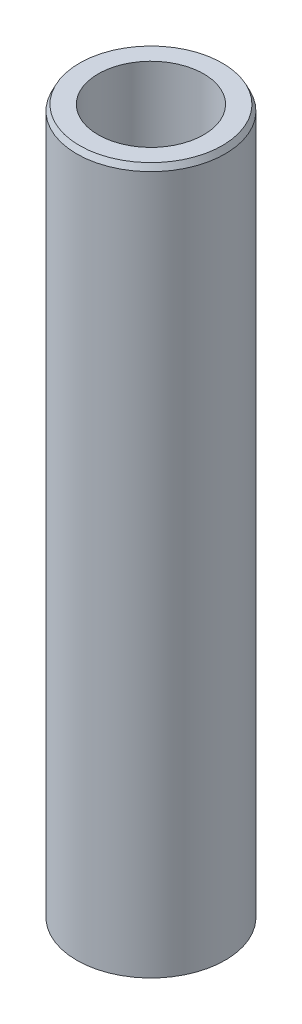
ISO-10303-21;
HEADER;
FILE_DESCRIPTION(('STEP AP214'),'2;1');
FILE_NAME('part.step','',(''),(''),'','','');
FILE_SCHEMA(('AUTOMOTIVE_DESIGN { 1 0 10303 214 1 1 1 1 }'));
ENDSEC;
DATA;
#1=APPLICATION_CONTEXT('core data for automotive mechanical design processes');
#2=APPLICATION_PROTOCOL_DEFINITION('international standard','automotive_design',2000,#1);
#3=PRODUCT_CONTEXT('',#1,'mechanical');
#4=PRODUCT('Part','Part','',(#3));
#5=PRODUCT_RELATED_PRODUCT_CATEGORY('part','',(#4));
#6=PRODUCT_DEFINITION_FORMATION('','',#4);
#7=PRODUCT_DEFINITION_CONTEXT('part definition',#1,'design');
#8=PRODUCT_DEFINITION('design','',#6,#7);
#9=PRODUCT_DEFINITION_SHAPE('','',#8);
#10=(LENGTH_UNIT() NAMED_UNIT(*) SI_UNIT(.MILLI.,.METRE.));
#11=(NAMED_UNIT(*) PLANE_ANGLE_UNIT() SI_UNIT($,.RADIAN.));
#12=(NAMED_UNIT(*) SI_UNIT($,.STERADIAN.) SOLID_ANGLE_UNIT());
#13=UNCERTAINTY_MEASURE_WITH_UNIT(LENGTH_MEASURE(1.E-05),#10,'distance_accuracy_value','');
#14=(GEOMETRIC_REPRESENTATION_CONTEXT(3) GLOBAL_UNCERTAINTY_ASSIGNED_CONTEXT((#13)) GLOBAL_UNIT_ASSIGNED_CONTEXT((#10,
#11,#12)) REPRESENTATION_CONTEXT('',''));
#15=CARTESIAN_POINT('',(0.,0.,0.));
#16=DIRECTION('',(0.,0.,1.));
#17=DIRECTION('',(1.,0.,0.));
#18=AXIS2_PLACEMENT_3D('',#15,#16,#17);
#19=CARTESIAN_POINT('',(0.,476.060575570618,0.));
#20=DIRECTION('',(0.,-1.,0.));
#21=DIRECTION('',(0.,0.,-1.));
#22=AXIS2_PLACEMENT_3D('',#19,#20,#21);
#23=CYLINDRICAL_SURFACE('',#22,50.);
#24=CARTESIAN_POINT('',(0.,472.135461206192,0.));
#25=DIRECTION('',(0.,1.,0.));
#26=DIRECTION('',(0.,0.,1.));
#27=AXIS2_PLACEMENT_3D('',#24,#25,#26);
#28=CIRCLE('',#27,50.);
#29=CARTESIAN_POINT('',(0.,472.135461206192,50.));
#30=VERTEX_POINT('',#29);
#31=EDGE_CURVE('E50',#30,#30,#28,.F.);
#32=ORIENTED_EDGE('',*,*,#31,.T.);
#33=EDGE_LOOP('',(#32));
#34=FACE_BOUND('',#33,.T.);
#35=CARTESIAN_POINT('',(0.,1.89745060686775,0.));
#36=DIRECTION('',(0.,1.,0.));
#37=DIRECTION('',(0.,0.,1.));
#38=AXIS2_PLACEMENT_3D('',#35,#36,#37);
#39=CIRCLE('',#38,50.);
#40=CARTESIAN_POINT('',(0.,1.89745060686775,50.));
#41=VERTEX_POINT('',#40);
#42=EDGE_CURVE('E51',#41,#41,#39,.T.);
#43=ORIENTED_EDGE('',*,*,#42,.T.);
#44=EDGE_LOOP('',(#43));
#45=FACE_BOUND('',#44,.T.);
#46=ADVANCED_FACE('F39',(#34,#45),#23,.T.);
#47=CARTESIAN_POINT('',(0.,476.060575570618,0.));
#48=DIRECTION('',(0.,1.,0.));
#49=DIRECTION('',(0.,0.,1.));
#50=AXIS2_PLACEMENT_3D('',#47,#48,#49);
#51=PLANE('',#50);
#52=CARTESIAN_POINT('',(0.,476.060575570618,0.));
#53=DIRECTION('',(0.,1.,0.));
#54=DIRECTION('',(0.,0.,1.));
#55=AXIS2_PLACEMENT_3D('',#52,#53,#54);
#56=CIRCLE('',#55,48.1025493931324);
#57=CARTESIAN_POINT('',(0.,476.060575570618,48.1025493931324));
#58=VERTEX_POINT('',#57);
#59=EDGE_CURVE('E54',#58,#58,#56,.T.);
#60=ORIENTED_EDGE('',*,*,#59,.T.);
#61=EDGE_LOOP('',(#60));
#62=FACE_BOUND('',#61,.T.);
#63=CARTESIAN_POINT('',(0.,476.060575570618,0.));
#64=DIRECTION('',(0.,1.,0.));
#65=DIRECTION('',(0.,0.,1.));
#66=AXIS2_PLACEMENT_3D('',#63,#64,#65);
#67=CIRCLE('',#66,35.5495999950527);
#68=CARTESIAN_POINT('',(0.,476.060575570618,35.5495999950527));
#69=VERTEX_POINT('',#68);
#70=EDGE_CURVE('E58',#69,#69,#67,.T.);
#71=ORIENTED_EDGE('',*,*,#70,.F.);
#72=EDGE_LOOP('',(#71));
#73=FACE_BOUND('',#72,.T.);
#74=ADVANCED_FACE('F69',(#62,#73),#51,.T.);
#75=CARTESIAN_POINT('',(0.,0.,0.));
#76=DIRECTION('',(0.,1.,0.));
#77=DIRECTION('',(0.,0.,1.));
#78=AXIS2_PLACEMENT_3D('',#75,#76,#77);
#79=PLANE('',#78);
#80=CARTESIAN_POINT('',(0.,0.,0.));
#81=DIRECTION('',(0.,1.,0.));
#82=DIRECTION('',(0.,0.,1.));
#83=AXIS2_PLACEMENT_3D('',#80,#81,#82);
#84=CIRCLE('',#83,46.0748856355734);
#85=CARTESIAN_POINT('',(0.,0.,46.0748856355734));
#86=VERTEX_POINT('',#85);
#87=EDGE_CURVE('E10',#86,#86,#84,.F.);
#88=ORIENTED_EDGE('',*,*,#87,.T.);
#89=EDGE_LOOP('',(#88));
#90=FACE_BOUND('',#89,.T.);
#91=CARTESIAN_POINT('',(0.,0.,0.));
#92=DIRECTION('',(0.,1.,0.));
#93=DIRECTION('',(0.,0.,1.));
#94=AXIS2_PLACEMENT_3D('',#91,#92,#93);
#95=CIRCLE('',#94,35.5495999950527);
#96=CARTESIAN_POINT('',(0.,0.,35.5495999950527));
#97=VERTEX_POINT('',#96);
#98=EDGE_CURVE('E63',#97,#97,#95,.T.);
#99=ORIENTED_EDGE('',*,*,#98,.T.);
#100=EDGE_LOOP('',(#99));
#101=FACE_BOUND('',#100,.T.);
#102=ADVANCED_FACE('F75',(#90,#101),#79,.F.);
#103=CARTESIAN_POINT('',(0.,476.060575570618,0.));
#104=DIRECTION('',(0.,-1.,0.));
#105=DIRECTION('',(0.,0.,-1.));
#106=AXIS2_PLACEMENT_3D('',#103,#104,#105);
#107=CYLINDRICAL_SURFACE('',#106,35.5495999950527);
#108=ORIENTED_EDGE('',*,*,#70,.T.);
#109=EDGE_LOOP('',(#108));
#110=FACE_BOUND('',#109,.T.);
#111=ORIENTED_EDGE('',*,*,#98,.F.);
#112=EDGE_LOOP('',(#111));
#113=FACE_BOUND('',#112,.T.);
#114=ADVANCED_FACE('F70',(#110,#113),#107,.F.);
#115=CARTESIAN_POINT('',(0.,476.060575570618,0.));
#116=DIRECTION('',(0.,-1.,0.));
#117=DIRECTION('',(0.,0.,-1.));
#118=AXIS2_PLACEMENT_3D('',#115,#116,#117);
#119=CONICAL_SURFACE('',#118,48.1025493931324,0.450290029038457);
#120=ORIENTED_EDGE('',*,*,#31,.F.);
#121=EDGE_LOOP('',(#120));
#122=FACE_BOUND('',#121,.T.);
#123=ORIENTED_EDGE('',*,*,#59,.F.);
#124=EDGE_LOOP('',(#123));
#125=FACE_BOUND('',#124,.T.);
#126=ADVANCED_FACE('F81',(#122,#125),#119,.T.);
#127=CARTESIAN_POINT('',(0.,1.89745060686775,0.));
#128=DIRECTION('',(0.,1.,0.));
#129=DIRECTION('',(0.,0.,1.));
#130=AXIS2_PLACEMENT_3D('',#127,#128,#129);
#131=CONICAL_SURFACE('',#130,50.,1.12050629775645);
#132=ORIENTED_EDGE('',*,*,#87,.F.);
#133=EDGE_LOOP('',(#132));
#134=FACE_BOUND('',#133,.T.);
#135=ORIENTED_EDGE('',*,*,#42,.F.);
#136=EDGE_LOOP('',(#135));
#137=FACE_BOUND('',#136,.T.);
#138=ADVANCED_FACE('F45',(#134,#137),#131,.T.);
#139=CLOSED_SHELL('',(#46,#74,#102,#114,#126,#138));
#140=MANIFOLD_SOLID_BREP('B2',#139);
#141=ADVANCED_BREP_SHAPE_REPRESENTATION('',(#18,#140),#14);
#142=SHAPE_DEFINITION_REPRESENTATION(#9,#141);
ENDSEC;
END-ISO-10303-21;
